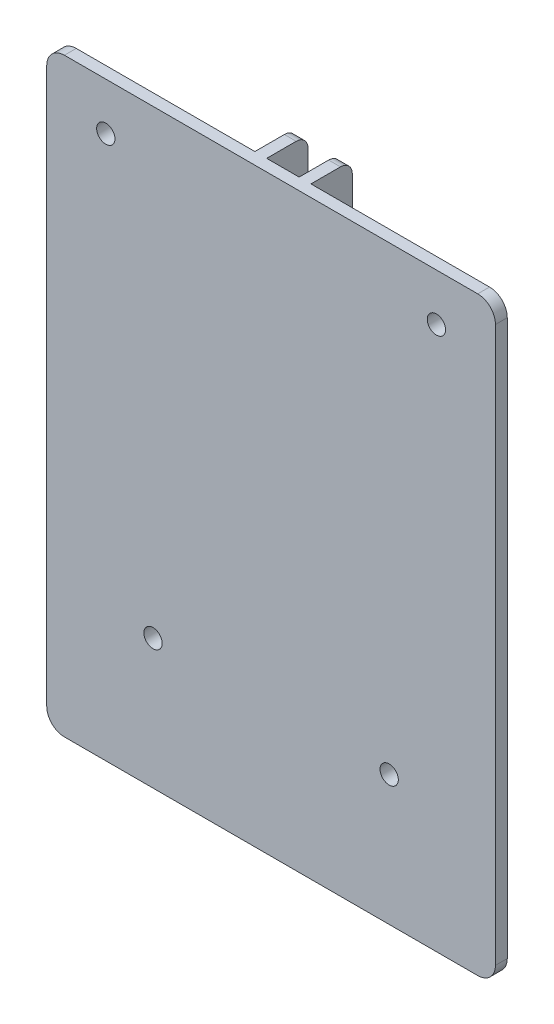
ISO-10303-21;
HEADER;
FILE_DESCRIPTION(('STEP AP214'),'2;1');
FILE_NAME('part.step','',(''),(''),'','','');
FILE_SCHEMA(('AUTOMOTIVE_DESIGN { 1 0 10303 214 1 1 1 1 }'));
ENDSEC;
DATA;
#1=APPLICATION_CONTEXT('core data for automotive mechanical design processes');
#2=APPLICATION_PROTOCOL_DEFINITION('international standard','automotive_design',2000,#1);
#3=PRODUCT_CONTEXT('',#1,'mechanical');
#4=PRODUCT('Part','Part','',(#3));
#5=PRODUCT_RELATED_PRODUCT_CATEGORY('part','',(#4));
#6=PRODUCT_DEFINITION_FORMATION('','',#4);
#7=PRODUCT_DEFINITION_CONTEXT('part definition',#1,'design');
#8=PRODUCT_DEFINITION('design','',#6,#7);
#9=PRODUCT_DEFINITION_SHAPE('','',#8);
#10=(LENGTH_UNIT() NAMED_UNIT(*) SI_UNIT(.MILLI.,.METRE.));
#11=(NAMED_UNIT(*) PLANE_ANGLE_UNIT() SI_UNIT($,.RADIAN.));
#12=(NAMED_UNIT(*) SI_UNIT($,.STERADIAN.) SOLID_ANGLE_UNIT());
#13=UNCERTAINTY_MEASURE_WITH_UNIT(LENGTH_MEASURE(1.E-05),#10,'distance_accuracy_value','');
#14=(GEOMETRIC_REPRESENTATION_CONTEXT(3) GLOBAL_UNCERTAINTY_ASSIGNED_CONTEXT((#13)) GLOBAL_UNIT_ASSIGNED_CONTEXT((#10,
#11,#12)) REPRESENTATION_CONTEXT('',''));
#15=CARTESIAN_POINT('',(0.,0.,0.));
#16=DIRECTION('',(0.,0.,1.));
#17=DIRECTION('',(1.,0.,0.));
#18=AXIS2_PLACEMENT_3D('',#15,#16,#17);
#19=CARTESIAN_POINT('',(0.,0.,9.));
#20=DIRECTION('',(1.,0.,0.));
#21=DIRECTION('',(0.,0.,-1.));
#22=AXIS2_PLACEMENT_3D('',#19,#20,#21);
#23=PLANE('',#22);
#24=DIRECTION('',(0.,1.,0.));
#25=VECTOR('',#24,1.);
#26=CARTESIAN_POINT('',(0.,100.,7.));
#27=LINE('',#26,#25);
#28=CARTESIAN_POINT('',(0.,3.,7.));
#29=VERTEX_POINT('',#28);
#30=CARTESIAN_POINT('',(0.,97.,7.));
#31=VERTEX_POINT('',#30);
#32=EDGE_CURVE('E202',#29,#31,#27,.T.);
#33=ORIENTED_EDGE('',*,*,#32,.F.);
#34=DIRECTION('',(0.,0.,-1.));
#35=VECTOR('',#34,1.);
#36=CARTESIAN_POINT('',(0.,3.,9.));
#37=LINE('',#36,#35);
#38=CARTESIAN_POINT('',(0.,3.,9.));
#39=VERTEX_POINT('',#38);
#40=EDGE_CURVE('E293',#29,#39,#37,.F.);
#41=ORIENTED_EDGE('',*,*,#40,.T.);
#42=DIRECTION('',(0.,-1.,0.));
#43=VECTOR('',#42,1.);
#44=CARTESIAN_POINT('',(0.,0.,9.));
#45=LINE('',#44,#43);
#46=CARTESIAN_POINT('',(0.,97.,9.));
#47=VERTEX_POINT('',#46);
#48=EDGE_CURVE('E211',#47,#39,#45,.T.);
#49=ORIENTED_EDGE('',*,*,#48,.F.);
#50=DIRECTION('',(0.,0.,-1.));
#51=VECTOR('',#50,1.);
#52=CARTESIAN_POINT('',(0.,97.,9.));
#53=LINE('',#52,#51);
#54=EDGE_CURVE('E290',#47,#31,#53,.T.);
#55=ORIENTED_EDGE('',*,*,#54,.T.);
#56=EDGE_LOOP('',(#33,#41,#49,#55));
#57=FACE_BOUND('',#56,.T.);
#58=ADVANCED_FACE('F32',(#57),#23,.F.);
#59=CARTESIAN_POINT('',(76.,0.,9.));
#60=DIRECTION('',(-1.,0.,0.));
#61=DIRECTION('',(0.,0.,1.));
#62=AXIS2_PLACEMENT_3D('',#59,#60,#61);
#63=PLANE('',#62);
#64=DIRECTION('',(0.,1.,0.));
#65=VECTOR('',#64,1.);
#66=CARTESIAN_POINT('',(76.,0.,9.));
#67=LINE('',#66,#65);
#68=CARTESIAN_POINT('',(76.,3.,9.));
#69=VERTEX_POINT('',#68);
#70=CARTESIAN_POINT('',(76.,97.,9.));
#71=VERTEX_POINT('',#70);
#72=EDGE_CURVE('E267',#69,#71,#67,.T.);
#73=ORIENTED_EDGE('',*,*,#72,.F.);
#74=DIRECTION('',(0.,0.,-1.));
#75=VECTOR('',#74,1.);
#76=CARTESIAN_POINT('',(76.,3.,9.));
#77=LINE('',#76,#75);
#78=CARTESIAN_POINT('',(76.,3.,7.));
#79=VERTEX_POINT('',#78);
#80=EDGE_CURVE('E305',#69,#79,#77,.T.);
#81=ORIENTED_EDGE('',*,*,#80,.T.);
#82=DIRECTION('',(0.,-1.,0.));
#83=VECTOR('',#82,1.);
#84=CARTESIAN_POINT('',(76.,100.,7.));
#85=LINE('',#84,#83);
#86=CARTESIAN_POINT('',(76.,97.,7.));
#87=VERTEX_POINT('',#86);
#88=EDGE_CURVE('E213',#87,#79,#85,.T.);
#89=ORIENTED_EDGE('',*,*,#88,.F.);
#90=DIRECTION('',(0.,0.,-1.));
#91=VECTOR('',#90,1.);
#92=CARTESIAN_POINT('',(76.,97.,9.));
#93=LINE('',#92,#91);
#94=EDGE_CURVE('E303',#87,#71,#93,.F.);
#95=ORIENTED_EDGE('',*,*,#94,.T.);
#96=EDGE_LOOP('',(#73,#81,#89,#95));
#97=FACE_BOUND('',#96,.T.);
#98=ADVANCED_FACE('F421',(#97),#63,.F.);
#99=CARTESIAN_POINT('',(0.,0.,0.));
#100=DIRECTION('',(0.,0.,-1.));
#101=DIRECTION('',(-1.,0.,0.));
#102=AXIS2_PLACEMENT_3D('',#99,#100,#101);
#103=PLANE('',#102);
#104=DIRECTION('',(0.,1.,0.));
#105=VECTOR('',#104,1.);
#106=CARTESIAN_POINT('',(35.25,100.,0.));
#107=LINE('',#106,#105);
#108=CARTESIAN_POINT('',(35.25,2.,0.));
#109=VERTEX_POINT('',#108);
#110=CARTESIAN_POINT('',(35.25,98.,0.));
#111=VERTEX_POINT('',#110);
#112=EDGE_CURVE('E247',#109,#111,#107,.T.);
#113=ORIENTED_EDGE('',*,*,#112,.F.);
#114=DIRECTION('',(1.,0.,0.));
#115=VECTOR('',#114,1.);
#116=CARTESIAN_POINT('',(33.25,2.,0.));
#117=LINE('',#116,#115);
#118=CARTESIAN_POINT('',(33.25,2.,0.));
#119=VERTEX_POINT('',#118);
#120=EDGE_CURVE('E328',#109,#119,#117,.F.);
#121=ORIENTED_EDGE('',*,*,#120,.T.);
#122=DIRECTION('',(0.,-1.,0.));
#123=VECTOR('',#122,1.);
#124=CARTESIAN_POINT('',(33.25,100.,0.));
#125=LINE('',#124,#123);
#126=CARTESIAN_POINT('',(33.25,98.,0.));
#127=VERTEX_POINT('',#126);
#128=EDGE_CURVE('E195',#127,#119,#125,.T.);
#129=ORIENTED_EDGE('',*,*,#128,.F.);
#130=DIRECTION('',(-1.,0.,0.));
#131=VECTOR('',#130,1.);
#132=CARTESIAN_POINT('',(35.25,98.,0.));
#133=LINE('',#132,#131);
#134=EDGE_CURVE('E326',#127,#111,#133,.F.);
#135=ORIENTED_EDGE('',*,*,#134,.T.);
#136=EDGE_LOOP('',(#113,#121,#129,#135));
#137=FACE_BOUND('',#136,.T.);
#138=ADVANCED_FACE('F427',(#137),#103,.T.);
#139=CARTESIAN_POINT('',(0.,0.,9.));
#140=DIRECTION('',(0.,1.,0.));
#141=DIRECTION('',(0.,0.,1.));
#142=AXIS2_PLACEMENT_3D('',#139,#140,#141);
#143=PLANE('',#142);
#144=DIRECTION('',(0.,0.,-1.));
#145=VECTOR('',#144,1.);
#146=CARTESIAN_POINT('',(33.25,0.,7.));
#147=LINE('',#146,#145);
#148=CARTESIAN_POINT('',(33.25,0.,7.));
#149=VERTEX_POINT('',#148);
#150=CARTESIAN_POINT('',(33.25,0.,2.));
#151=VERTEX_POINT('',#150);
#152=EDGE_CURVE('E174',#149,#151,#147,.T.);
#153=ORIENTED_EDGE('',*,*,#152,.T.);
#154=DIRECTION('',(1.,0.,0.));
#155=VECTOR('',#154,1.);
#156=CARTESIAN_POINT('',(35.25,0.,2.));
#157=LINE('',#156,#155);
#158=CARTESIAN_POINT('',(35.25,0.,2.));
#159=VERTEX_POINT('',#158);
#160=EDGE_CURVE('E320',#151,#159,#157,.T.);
#161=ORIENTED_EDGE('',*,*,#160,.T.);
#162=DIRECTION('',(0.,0.,-1.));
#163=VECTOR('',#162,1.);
#164=CARTESIAN_POINT('',(35.25,0.,7.));
#165=LINE('',#164,#163);
#166=CARTESIAN_POINT('',(35.25,0.,7.));
#167=VERTEX_POINT('',#166);
#168=EDGE_CURVE('E228',#167,#159,#165,.T.);
#169=ORIENTED_EDGE('',*,*,#168,.F.);
#170=DIRECTION('',(-1.,0.,0.));
#171=VECTOR('',#170,1.);
#172=CARTESIAN_POINT('',(35.25,0.,7.));
#173=LINE('',#172,#171);
#174=CARTESIAN_POINT('',(40.75,0.,7.));
#175=VERTEX_POINT('',#174);
#176=EDGE_CURVE('E243',#175,#167,#173,.T.);
#177=ORIENTED_EDGE('',*,*,#176,.F.);
#178=DIRECTION('',(0.,0.,-1.));
#179=VECTOR('',#178,1.);
#180=CARTESIAN_POINT('',(40.75,0.,7.));
#181=LINE('',#180,#179);
#182=CARTESIAN_POINT('',(40.75,0.,2.));
#183=VERTEX_POINT('',#182);
#184=EDGE_CURVE('E254',#175,#183,#181,.T.);
#185=ORIENTED_EDGE('',*,*,#184,.T.);
#186=DIRECTION('',(1.,0.,0.));
#187=VECTOR('',#186,1.);
#188=CARTESIAN_POINT('',(42.75,0.,2.));
#189=LINE('',#188,#187);
#190=CARTESIAN_POINT('',(42.75,0.,2.));
#191=VERTEX_POINT('',#190);
#192=EDGE_CURVE('E317',#183,#191,#189,.T.);
#193=ORIENTED_EDGE('',*,*,#192,.T.);
#194=DIRECTION('',(0.,0.,-1.));
#195=VECTOR('',#194,1.);
#196=CARTESIAN_POINT('',(42.75,0.,7.));
#197=LINE('',#196,#195);
#198=CARTESIAN_POINT('',(42.75,0.,7.));
#199=VERTEX_POINT('',#198);
#200=EDGE_CURVE('E225',#199,#191,#197,.T.);
#201=ORIENTED_EDGE('',*,*,#200,.F.);
#202=DIRECTION('',(-1.,0.,0.));
#203=VECTOR('',#202,1.);
#204=CARTESIAN_POINT('',(76.,0.,7.));
#205=LINE('',#204,#203);
#206=CARTESIAN_POINT('',(73.,0.,7.));
#207=VERTEX_POINT('',#206);
#208=EDGE_CURVE('E216',#207,#199,#205,.T.);
#209=ORIENTED_EDGE('',*,*,#208,.F.);
#210=DIRECTION('',(0.,0.,-1.));
#211=VECTOR('',#210,1.);
#212=CARTESIAN_POINT('',(73.,0.,9.));
#213=LINE('',#212,#211);
#214=CARTESIAN_POINT('',(73.,0.,9.));
#215=VERTEX_POINT('',#214);
#216=EDGE_CURVE('E273',#207,#215,#213,.F.);
#217=ORIENTED_EDGE('',*,*,#216,.T.);
#218=DIRECTION('',(1.,0.,0.));
#219=VECTOR('',#218,1.);
#220=CARTESIAN_POINT('',(0.,0.,9.));
#221=LINE('',#220,#219);
#222=CARTESIAN_POINT('',(3.,0.,9.));
#223=VERTEX_POINT('',#222);
#224=EDGE_CURVE('E264',#223,#215,#221,.T.);
#225=ORIENTED_EDGE('',*,*,#224,.F.);
#226=DIRECTION('',(0.,0.,-1.));
#227=VECTOR('',#226,1.);
#228=CARTESIAN_POINT('',(3.,0.,9.));
#229=LINE('',#228,#227);
#230=CARTESIAN_POINT('',(3.,0.,7.));
#231=VERTEX_POINT('',#230);
#232=EDGE_CURVE('E201',#223,#231,#229,.T.);
#233=ORIENTED_EDGE('',*,*,#232,.T.);
#234=DIRECTION('',(-1.,0.,0.));
#235=VECTOR('',#234,1.);
#236=CARTESIAN_POINT('',(33.25,0.,7.));
#237=LINE('',#236,#235);
#238=EDGE_CURVE('E193',#149,#231,#237,.T.);
#239=ORIENTED_EDGE('',*,*,#238,.F.);
#240=EDGE_LOOP('',(#153,#161,#169,#177,#185,#193,#201,#209,#217,#225,#233,#239));
#241=FACE_BOUND('',#240,.T.);
#242=ADVANCED_FACE('F198',(#241),#143,.F.);
#243=CARTESIAN_POINT('',(0.,100.,9.));
#244=DIRECTION('',(0.,-1.,0.));
#245=DIRECTION('',(0.,0.,-1.));
#246=AXIS2_PLACEMENT_3D('',#243,#244,#245);
#247=PLANE('',#246);
#248=DIRECTION('',(0.,0.,-1.));
#249=VECTOR('',#248,1.);
#250=CARTESIAN_POINT('',(35.25,100.,7.));
#251=LINE('',#250,#249);
#252=CARTESIAN_POINT('',(35.25,100.,7.));
#253=VERTEX_POINT('',#252);
#254=CARTESIAN_POINT('',(35.25,100.,2.));
#255=VERTEX_POINT('',#254);
#256=EDGE_CURVE('E246',#253,#255,#251,.T.);
#257=ORIENTED_EDGE('',*,*,#256,.T.);
#258=DIRECTION('',(-1.,0.,0.));
#259=VECTOR('',#258,1.);
#260=CARTESIAN_POINT('',(33.25,100.,2.));
#261=LINE('',#260,#259);
#262=CARTESIAN_POINT('',(33.25,100.,2.));
#263=VERTEX_POINT('',#262);
#264=EDGE_CURVE('E11',#255,#263,#261,.T.);
#265=ORIENTED_EDGE('',*,*,#264,.T.);
#266=DIRECTION('',(0.,0.,-1.));
#267=VECTOR('',#266,1.);
#268=CARTESIAN_POINT('',(33.25,100.,7.));
#269=LINE('',#268,#267);
#270=CARTESIAN_POINT('',(33.25,100.,7.));
#271=VERTEX_POINT('',#270);
#272=EDGE_CURVE('E187',#271,#263,#269,.T.);
#273=ORIENTED_EDGE('',*,*,#272,.F.);
#274=DIRECTION('',(1.,0.,0.));
#275=VECTOR('',#274,1.);
#276=CARTESIAN_POINT('',(33.25,100.,7.));
#277=LINE('',#276,#275);
#278=CARTESIAN_POINT('',(3.,100.,7.));
#279=VERTEX_POINT('',#278);
#280=EDGE_CURVE('E188',#279,#271,#277,.T.);
#281=ORIENTED_EDGE('',*,*,#280,.F.);
#282=DIRECTION('',(0.,0.,-1.));
#283=VECTOR('',#282,1.);
#284=CARTESIAN_POINT('',(3.,100.,9.));
#285=LINE('',#284,#283);
#286=CARTESIAN_POINT('',(3.,100.,9.));
#287=VERTEX_POINT('',#286);
#288=EDGE_CURVE('E315',#279,#287,#285,.F.);
#289=ORIENTED_EDGE('',*,*,#288,.T.);
#290=DIRECTION('',(-1.,0.,0.));
#291=VECTOR('',#290,1.);
#292=CARTESIAN_POINT('',(0.,100.,9.));
#293=LINE('',#292,#291);
#294=CARTESIAN_POINT('',(73.,100.,9.));
#295=VERTEX_POINT('',#294);
#296=EDGE_CURVE('E270',#295,#287,#293,.T.);
#297=ORIENTED_EDGE('',*,*,#296,.F.);
#298=DIRECTION('',(0.,0.,-1.));
#299=VECTOR('',#298,1.);
#300=CARTESIAN_POINT('',(73.,100.,9.));
#301=LINE('',#300,#299);
#302=CARTESIAN_POINT('',(73.,100.,7.));
#303=VERTEX_POINT('',#302);
#304=EDGE_CURVE('E312',#295,#303,#301,.T.);
#305=ORIENTED_EDGE('',*,*,#304,.T.);
#306=DIRECTION('',(1.,0.,0.));
#307=VECTOR('',#306,1.);
#308=CARTESIAN_POINT('',(76.,100.,7.));
#309=LINE('',#308,#307);
#310=CARTESIAN_POINT('',(42.75,100.,7.));
#311=VERTEX_POINT('',#310);
#312=EDGE_CURVE('E222',#311,#303,#309,.T.);
#313=ORIENTED_EDGE('',*,*,#312,.F.);
#314=DIRECTION('',(0.,0.,-1.));
#315=VECTOR('',#314,1.);
#316=CARTESIAN_POINT('',(42.75,100.,7.));
#317=LINE('',#316,#315);
#318=CARTESIAN_POINT('',(42.75,100.,2.));
#319=VERTEX_POINT('',#318);
#320=EDGE_CURVE('E210',#311,#319,#317,.T.);
#321=ORIENTED_EDGE('',*,*,#320,.T.);
#322=DIRECTION('',(-1.,0.,0.));
#323=VECTOR('',#322,1.);
#324=CARTESIAN_POINT('',(40.75,100.,2.));
#325=LINE('',#324,#323);
#326=CARTESIAN_POINT('',(40.75,100.,2.));
#327=VERTEX_POINT('',#326);
#328=EDGE_CURVE('E41',#319,#327,#325,.T.);
#329=ORIENTED_EDGE('',*,*,#328,.T.);
#330=DIRECTION('',(0.,0.,-1.));
#331=VECTOR('',#330,1.);
#332=CARTESIAN_POINT('',(40.75,100.,7.));
#333=LINE('',#332,#331);
#334=CARTESIAN_POINT('',(40.75,100.,7.));
#335=VERTEX_POINT('',#334);
#336=EDGE_CURVE('E257',#335,#327,#333,.T.);
#337=ORIENTED_EDGE('',*,*,#336,.F.);
#338=DIRECTION('',(1.,0.,0.));
#339=VECTOR('',#338,1.);
#340=CARTESIAN_POINT('',(35.25,100.,7.));
#341=LINE('',#340,#339);
#342=EDGE_CURVE('E236',#253,#335,#341,.T.);
#343=ORIENTED_EDGE('',*,*,#342,.F.);
#344=EDGE_LOOP('',(#257,#265,#273,#281,#289,#297,#305,#313,#321,#329,#337,#343));
#345=FACE_BOUND('',#344,.T.);
#346=ADVANCED_FACE('F469',(#345),#247,.F.);
#347=CARTESIAN_POINT('',(0.,0.,9.));
#348=DIRECTION('',(0.,0.,-1.));
#349=DIRECTION('',(-1.,0.,0.));
#350=AXIS2_PLACEMENT_3D('',#347,#348,#349);
#351=PLANE('',#350);
#352=CARTESIAN_POINT('',(66.,92.,9.));
#353=DIRECTION('',(0.,0.,-1.));
#354=DIRECTION('',(-1.,0.,0.));
#355=AXIS2_PLACEMENT_3D('',#352,#353,#354);
#356=CIRCLE('',#355,1.54999999999999);
#357=CARTESIAN_POINT('',(64.45,92.,9.));
#358=VERTEX_POINT('',#357);
#359=EDGE_CURVE('E348',#358,#358,#356,.T.);
#360=ORIENTED_EDGE('',*,*,#359,.T.);
#361=EDGE_LOOP('',(#360));
#362=FACE_BOUND('',#361,.T.);
#363=CARTESIAN_POINT('',(58.,22.,9.));
#364=DIRECTION('',(0.,0.,-1.));
#365=DIRECTION('',(-1.,0.,0.));
#366=AXIS2_PLACEMENT_3D('',#363,#364,#365);
#367=CIRCLE('',#366,1.55);
#368=CARTESIAN_POINT('',(56.45,22.,9.));
#369=VERTEX_POINT('',#368);
#370=EDGE_CURVE('E742',#369,#369,#367,.T.);
#371=ORIENTED_EDGE('',*,*,#370,.T.);
#372=EDGE_LOOP('',(#371));
#373=FACE_BOUND('',#372,.T.);
#374=CARTESIAN_POINT('',(18.,22.,9.));
#375=DIRECTION('',(0.,0.,-1.));
#376=DIRECTION('',(-1.,0.,0.));
#377=AXIS2_PLACEMENT_3D('',#374,#375,#376);
#378=CIRCLE('',#377,1.55);
#379=CARTESIAN_POINT('',(16.45,22.,9.));
#380=VERTEX_POINT('',#379);
#381=EDGE_CURVE('E745',#380,#380,#378,.T.);
#382=ORIENTED_EDGE('',*,*,#381,.T.);
#383=EDGE_LOOP('',(#382));
#384=FACE_BOUND('',#383,.T.);
#385=CARTESIAN_POINT('',(10.,92.,9.));
#386=DIRECTION('',(0.,0.,-1.));
#387=DIRECTION('',(-1.,0.,0.));
#388=AXIS2_PLACEMENT_3D('',#385,#386,#387);
#389=CIRCLE('',#388,1.54999999999999);
#390=CARTESIAN_POINT('',(8.45000000000001,92.,9.));
#391=VERTEX_POINT('',#390);
#392=EDGE_CURVE('E749',#391,#391,#389,.T.);
#393=ORIENTED_EDGE('',*,*,#392,.T.);
#394=EDGE_LOOP('',(#393));
#395=FACE_BOUND('',#394,.T.);
#396=ORIENTED_EDGE('',*,*,#48,.T.);
#397=CARTESIAN_POINT('',(3.,3.,9.));
#398=DIRECTION('',(0.,0.,-1.));
#399=DIRECTION('',(-1.,0.,0.));
#400=AXIS2_PLACEMENT_3D('',#397,#398,#399);
#401=CIRCLE('',#400,3.);
#402=EDGE_CURVE('E301',#39,#223,#401,.F.);
#403=ORIENTED_EDGE('',*,*,#402,.T.);
#404=ORIENTED_EDGE('',*,*,#224,.T.);
#405=CARTESIAN_POINT('',(73.,3.,9.));
#406=DIRECTION('',(0.,0.,-1.));
#407=DIRECTION('',(-1.,0.,0.));
#408=AXIS2_PLACEMENT_3D('',#405,#406,#407);
#409=CIRCLE('',#408,3.);
#410=EDGE_CURVE('E299',#215,#69,#409,.F.);
#411=ORIENTED_EDGE('',*,*,#410,.T.);
#412=ORIENTED_EDGE('',*,*,#72,.T.);
#413=CARTESIAN_POINT('',(73.,97.,9.));
#414=DIRECTION('',(0.,0.,-1.));
#415=DIRECTION('',(-1.,0.,0.));
#416=AXIS2_PLACEMENT_3D('',#413,#414,#415);
#417=CIRCLE('',#416,3.);
#418=EDGE_CURVE('E295',#71,#295,#417,.F.);
#419=ORIENTED_EDGE('',*,*,#418,.T.);
#420=ORIENTED_EDGE('',*,*,#296,.T.);
#421=CARTESIAN_POINT('',(3.,97.,9.));
#422=DIRECTION('',(0.,0.,-1.));
#423=DIRECTION('',(-1.,0.,0.));
#424=AXIS2_PLACEMENT_3D('',#421,#422,#423);
#425=CIRCLE('',#424,3.);
#426=EDGE_CURVE('E297',#287,#47,#425,.F.);
#427=ORIENTED_EDGE('',*,*,#426,.T.);
#428=EDGE_LOOP('',(#396,#403,#404,#411,#412,#419,#420,#427));
#429=FACE_BOUND('',#428,.T.);
#430=ADVANCED_FACE('F484',(#362,#373,#384,#395,#429),#351,.F.);
#431=DIRECTION('',(0.,1.,0.));
#432=VECTOR('',#431,1.);
#433=CARTESIAN_POINT('',(42.75,100.,0.));
#434=LINE('',#433,#432);
#435=CARTESIAN_POINT('',(42.75,2.,0.));
#436=VERTEX_POINT('',#435);
#437=CARTESIAN_POINT('',(42.75,98.,0.));
#438=VERTEX_POINT('',#437);
#439=EDGE_CURVE('E217',#436,#438,#434,.T.);
#440=ORIENTED_EDGE('',*,*,#439,.F.);
#441=DIRECTION('',(1.,0.,0.));
#442=VECTOR('',#441,1.);
#443=CARTESIAN_POINT('',(40.75,2.,0.));
#444=LINE('',#443,#442);
#445=CARTESIAN_POINT('',(40.75,2.,0.));
#446=VERTEX_POINT('',#445);
#447=EDGE_CURVE('E57',#436,#446,#444,.F.);
#448=ORIENTED_EDGE('',*,*,#447,.T.);
#449=DIRECTION('',(0.,-1.,0.));
#450=VECTOR('',#449,1.);
#451=CARTESIAN_POINT('',(40.75,100.,0.));
#452=LINE('',#451,#450);
#453=CARTESIAN_POINT('',(40.75,98.,0.));
#454=VERTEX_POINT('',#453);
#455=EDGE_CURVE('E237',#454,#446,#452,.T.);
#456=ORIENTED_EDGE('',*,*,#455,.F.);
#457=DIRECTION('',(-1.,0.,0.));
#458=VECTOR('',#457,1.);
#459=CARTESIAN_POINT('',(42.75,98.,0.));
#460=LINE('',#459,#458);
#461=EDGE_CURVE('E337',#454,#438,#460,.F.);
#462=ORIENTED_EDGE('',*,*,#461,.T.);
#463=EDGE_LOOP('',(#440,#448,#456,#462));
#464=FACE_BOUND('',#463,.T.);
#465=ADVANCED_FACE('F506',(#464),#103,.T.);
#466=CARTESIAN_POINT('',(35.25,100.,7.));
#467=DIRECTION('',(-1.,0.,0.));
#468=DIRECTION('',(0.,-1.,0.));
#469=AXIS2_PLACEMENT_3D('',#466,#467,#468);
#470=PLANE('',#469);
#471=CARTESIAN_POINT('',(35.25,15.,3.5));
#472=DIRECTION('',(-1.,0.,0.));
#473=DIRECTION('',(0.,-1.,0.));
#474=AXIS2_PLACEMENT_3D('',#471,#472,#473);
#475=CIRCLE('',#474,1.55);
#476=CARTESIAN_POINT('',(35.25,13.45,3.5));
#477=VERTEX_POINT('',#476);
#478=EDGE_CURVE('E250',#477,#477,#475,.T.);
#479=ORIENTED_EDGE('',*,*,#478,.T.);
#480=EDGE_LOOP('',(#479));
#481=FACE_BOUND('',#480,.T.);
#482=CARTESIAN_POINT('',(35.25,85.,3.5));
#483=DIRECTION('',(-1.,0.,0.));
#484=DIRECTION('',(0.,-1.,0.));
#485=AXIS2_PLACEMENT_3D('',#482,#483,#484);
#486=CIRCLE('',#485,1.54999999999999);
#487=CARTESIAN_POINT('',(35.25,83.45,3.5));
#488=VERTEX_POINT('',#487);
#489=EDGE_CURVE('E283',#488,#488,#486,.T.);
#490=ORIENTED_EDGE('',*,*,#489,.T.);
#491=EDGE_LOOP('',(#490));
#492=FACE_BOUND('',#491,.T.);
#493=ORIENTED_EDGE('',*,*,#168,.T.);
#494=CARTESIAN_POINT('',(35.25,2.,2.));
#495=DIRECTION('',(-1.,0.,0.));
#496=DIRECTION('',(0.,-1.,0.));
#497=AXIS2_PLACEMENT_3D('',#494,#495,#496);
#498=CIRCLE('',#497,2.);
#499=EDGE_CURVE('E324',#159,#109,#498,.F.);
#500=ORIENTED_EDGE('',*,*,#499,.T.);
#501=ORIENTED_EDGE('',*,*,#112,.T.);
#502=CARTESIAN_POINT('',(35.25,98.,2.));
#503=DIRECTION('',(-1.,0.,0.));
#504=DIRECTION('',(0.,-1.,0.));
#505=AXIS2_PLACEMENT_3D('',#502,#503,#504);
#506=CIRCLE('',#505,2.);
#507=EDGE_CURVE('E322',#111,#255,#506,.F.);
#508=ORIENTED_EDGE('',*,*,#507,.T.);
#509=ORIENTED_EDGE('',*,*,#256,.F.);
#510=DIRECTION('',(0.,1.,0.));
#511=VECTOR('',#510,1.);
#512=CARTESIAN_POINT('',(35.25,100.,7.));
#513=LINE('',#512,#511);
#514=EDGE_CURVE('E233',#167,#253,#513,.T.);
#515=ORIENTED_EDGE('',*,*,#514,.F.);
#516=EDGE_LOOP('',(#493,#500,#501,#508,#509,#515));
#517=FACE_BOUND('',#516,.T.);
#518=ADVANCED_FACE('F398',(#481,#492,#517),#470,.F.);
#519=CARTESIAN_POINT('',(40.75,100.,7.));
#520=DIRECTION('',(1.,0.,0.));
#521=DIRECTION('',(0.,1.,0.));
#522=AXIS2_PLACEMENT_3D('',#519,#520,#521);
#523=PLANE('',#522);
#524=CARTESIAN_POINT('',(40.75,15.,3.5));
#525=DIRECTION('',(1.,0.,0.));
#526=DIRECTION('',(0.,1.,0.));
#527=AXIS2_PLACEMENT_3D('',#524,#525,#526);
#528=CIRCLE('',#527,1.55);
#529=CARTESIAN_POINT('',(40.75,16.55,3.5));
#530=VERTEX_POINT('',#529);
#531=EDGE_CURVE('E282',#530,#530,#528,.T.);
#532=ORIENTED_EDGE('',*,*,#531,.T.);
#533=EDGE_LOOP('',(#532));
#534=FACE_BOUND('',#533,.T.);
#535=CARTESIAN_POINT('',(40.75,85.,3.5));
#536=DIRECTION('',(1.,0.,0.));
#537=DIRECTION('',(0.,1.,0.));
#538=AXIS2_PLACEMENT_3D('',#535,#536,#537);
#539=CIRCLE('',#538,1.54999999999999);
#540=CARTESIAN_POINT('',(40.75,86.55,3.5));
#541=VERTEX_POINT('',#540);
#542=EDGE_CURVE('E277',#541,#541,#539,.T.);
#543=ORIENTED_EDGE('',*,*,#542,.T.);
#544=EDGE_LOOP('',(#543));
#545=FACE_BOUND('',#544,.T.);
#546=ORIENTED_EDGE('',*,*,#455,.T.);
#547=CARTESIAN_POINT('',(40.75,2.,2.));
#548=DIRECTION('',(1.,0.,0.));
#549=DIRECTION('',(0.,1.,0.));
#550=AXIS2_PLACEMENT_3D('',#547,#548,#549);
#551=CIRCLE('',#550,2.);
#552=EDGE_CURVE('E341',#446,#183,#551,.F.);
#553=ORIENTED_EDGE('',*,*,#552,.T.);
#554=ORIENTED_EDGE('',*,*,#184,.F.);
#555=DIRECTION('',(0.,-1.,0.));
#556=VECTOR('',#555,1.);
#557=CARTESIAN_POINT('',(40.75,100.,7.));
#558=LINE('',#557,#556);
#559=EDGE_CURVE('E240',#335,#175,#558,.T.);
#560=ORIENTED_EDGE('',*,*,#559,.F.);
#561=ORIENTED_EDGE('',*,*,#336,.T.);
#562=CARTESIAN_POINT('',(40.75,98.,2.));
#563=DIRECTION('',(1.,0.,0.));
#564=DIRECTION('',(0.,1.,0.));
#565=AXIS2_PLACEMENT_3D('',#562,#563,#564);
#566=CIRCLE('',#565,2.);
#567=EDGE_CURVE('E49',#327,#454,#566,.F.);
#568=ORIENTED_EDGE('',*,*,#567,.T.);
#569=EDGE_LOOP('',(#546,#553,#554,#560,#561,#568));
#570=FACE_BOUND('',#569,.T.);
#571=ADVANCED_FACE('F508',(#534,#545,#570),#523,.F.);
#572=CARTESIAN_POINT('',(0.,0.,7.));
#573=DIRECTION('',(0.,0.,1.));
#574=DIRECTION('',(1.,0.,0.));
#575=AXIS2_PLACEMENT_3D('',#572,#573,#574);
#576=PLANE('',#575);
#577=ORIENTED_EDGE('',*,*,#514,.T.);
#578=ORIENTED_EDGE('',*,*,#342,.T.);
#579=ORIENTED_EDGE('',*,*,#559,.T.);
#580=ORIENTED_EDGE('',*,*,#176,.T.);
#581=EDGE_LOOP('',(#577,#578,#579,#580));
#582=FACE_BOUND('',#581,.T.);
#583=ADVANCED_FACE('F472',(#582),#576,.F.);
#584=CARTESIAN_POINT('',(42.75,100.,7.));
#585=DIRECTION('',(-1.,0.,0.));
#586=DIRECTION('',(0.,-1.,0.));
#587=AXIS2_PLACEMENT_3D('',#584,#585,#586);
#588=PLANE('',#587);
#589=CARTESIAN_POINT('',(42.75,15.,3.5));
#590=DIRECTION('',(1.,0.,0.));
#591=DIRECTION('',(0.,1.,0.));
#592=AXIS2_PLACEMENT_3D('',#589,#590,#591);
#593=CIRCLE('',#592,1.55);
#594=CARTESIAN_POINT('',(42.75,16.55,3.5));
#595=VERTEX_POINT('',#594);
#596=EDGE_CURVE('E278',#595,#595,#593,.T.);
#597=ORIENTED_EDGE('',*,*,#596,.F.);
#598=EDGE_LOOP('',(#597));
#599=FACE_BOUND('',#598,.T.);
#600=CARTESIAN_POINT('',(42.75,85.,3.5));
#601=DIRECTION('',(1.,0.,0.));
#602=DIRECTION('',(0.,1.,0.));
#603=AXIS2_PLACEMENT_3D('',#600,#601,#602);
#604=CIRCLE('',#603,1.54999999999999);
#605=CARTESIAN_POINT('',(42.75,86.55,3.5));
#606=VERTEX_POINT('',#605);
#607=EDGE_CURVE('E383',#606,#606,#604,.T.);
#608=ORIENTED_EDGE('',*,*,#607,.F.);
#609=EDGE_LOOP('',(#608));
#610=FACE_BOUND('',#609,.T.);
#611=ORIENTED_EDGE('',*,*,#200,.T.);
#612=CARTESIAN_POINT('',(42.75,2.,2.));
#613=DIRECTION('',(-1.,0.,0.));
#614=DIRECTION('',(0.,-1.,0.));
#615=AXIS2_PLACEMENT_3D('',#612,#613,#614);
#616=CIRCLE('',#615,2.);
#617=EDGE_CURVE('E335',#191,#436,#616,.F.);
#618=ORIENTED_EDGE('',*,*,#617,.T.);
#619=ORIENTED_EDGE('',*,*,#439,.T.);
#620=CARTESIAN_POINT('',(42.75,98.,2.));
#621=DIRECTION('',(-1.,0.,0.));
#622=DIRECTION('',(0.,-1.,0.));
#623=AXIS2_PLACEMENT_3D('',#620,#621,#622);
#624=CIRCLE('',#623,2.);
#625=EDGE_CURVE('E333',#438,#319,#624,.F.);
#626=ORIENTED_EDGE('',*,*,#625,.T.);
#627=ORIENTED_EDGE('',*,*,#320,.F.);
#628=DIRECTION('',(0.,1.,0.));
#629=VECTOR('',#628,1.);
#630=CARTESIAN_POINT('',(42.75,100.,7.));
#631=LINE('',#630,#629);
#632=EDGE_CURVE('E219',#199,#311,#631,.T.);
#633=ORIENTED_EDGE('',*,*,#632,.F.);
#634=EDGE_LOOP('',(#611,#618,#619,#626,#627,#633));
#635=FACE_BOUND('',#634,.T.);
#636=ADVANCED_FACE('F502',(#599,#610,#635),#588,.F.);
#637=CARTESIAN_POINT('',(0.,0.,7.));
#638=DIRECTION('',(0.,0.,-1.));
#639=DIRECTION('',(-1.,0.,0.));
#640=AXIS2_PLACEMENT_3D('',#637,#638,#639);
#641=PLANE('',#640);
#642=CARTESIAN_POINT('',(58.,22.,7.));
#643=DIRECTION('',(0.,0.,-1.));
#644=DIRECTION('',(-1.,0.,0.));
#645=AXIS2_PLACEMENT_3D('',#642,#643,#644);
#646=CIRCLE('',#645,3.);
#647=CARTESIAN_POINT('',(55.,22.,7.));
#648=VERTEX_POINT('',#647);
#649=EDGE_CURVE('E355',#648,#648,#646,.T.);
#650=ORIENTED_EDGE('',*,*,#649,.F.);
#651=EDGE_LOOP('',(#650));
#652=FACE_BOUND('',#651,.T.);
#653=CARTESIAN_POINT('',(66.,92.,7.));
#654=DIRECTION('',(0.,0.,-1.));
#655=DIRECTION('',(-1.,0.,0.));
#656=AXIS2_PLACEMENT_3D('',#653,#654,#655);
#657=CIRCLE('',#656,3.00000000000001);
#658=CARTESIAN_POINT('',(63.,92.,7.));
#659=VERTEX_POINT('',#658);
#660=EDGE_CURVE('E377',#659,#659,#657,.T.);
#661=ORIENTED_EDGE('',*,*,#660,.F.);
#662=EDGE_LOOP('',(#661));
#663=FACE_BOUND('',#662,.T.);
#664=ORIENTED_EDGE('',*,*,#88,.T.);
#665=CARTESIAN_POINT('',(73.,3.,7.));
#666=DIRECTION('',(0.,0.,-1.));
#667=DIRECTION('',(-1.,0.,0.));
#668=AXIS2_PLACEMENT_3D('',#665,#666,#667);
#669=CIRCLE('',#668,3.);
#670=EDGE_CURVE('E310',#79,#207,#669,.T.);
#671=ORIENTED_EDGE('',*,*,#670,.T.);
#672=ORIENTED_EDGE('',*,*,#208,.T.);
#673=ORIENTED_EDGE('',*,*,#632,.T.);
#674=ORIENTED_EDGE('',*,*,#312,.T.);
#675=CARTESIAN_POINT('',(73.,97.,7.));
#676=DIRECTION('',(0.,0.,-1.));
#677=DIRECTION('',(-1.,0.,0.));
#678=AXIS2_PLACEMENT_3D('',#675,#676,#677);
#679=CIRCLE('',#678,3.);
#680=EDGE_CURVE('E308',#303,#87,#679,.T.);
#681=ORIENTED_EDGE('',*,*,#680,.T.);
#682=EDGE_LOOP('',(#664,#671,#672,#673,#674,#681));
#683=FACE_BOUND('',#682,.T.);
#684=ADVANCED_FACE('F499',(#652,#663,#683),#641,.T.);
#685=CARTESIAN_POINT('',(33.25,100.,7.));
#686=DIRECTION('',(1.,0.,0.));
#687=DIRECTION('',(0.,1.,0.));
#688=AXIS2_PLACEMENT_3D('',#685,#686,#687);
#689=PLANE('',#688);
#690=CARTESIAN_POINT('',(33.25,15.,3.5));
#691=DIRECTION('',(1.,0.,0.));
#692=DIRECTION('',(0.,1.,0.));
#693=AXIS2_PLACEMENT_3D('',#690,#691,#692);
#694=CIRCLE('',#693,1.55);
#695=CARTESIAN_POINT('',(33.25,16.55,3.5));
#696=VERTEX_POINT('',#695);
#697=EDGE_CURVE('E279',#696,#696,#694,.T.);
#698=ORIENTED_EDGE('',*,*,#697,.T.);
#699=EDGE_LOOP('',(#698));
#700=FACE_BOUND('',#699,.T.);
#701=CARTESIAN_POINT('',(33.25,85.,3.5));
#702=DIRECTION('',(1.,0.,0.));
#703=DIRECTION('',(0.,1.,0.));
#704=AXIS2_PLACEMENT_3D('',#701,#702,#703);
#705=CIRCLE('',#704,1.54999999999999);
#706=CARTESIAN_POINT('',(33.25,86.55,3.5));
#707=VERTEX_POINT('',#706);
#708=EDGE_CURVE('E274',#707,#707,#705,.T.);
#709=ORIENTED_EDGE('',*,*,#708,.T.);
#710=EDGE_LOOP('',(#709));
#711=FACE_BOUND('',#710,.T.);
#712=ORIENTED_EDGE('',*,*,#128,.T.);
#713=CARTESIAN_POINT('',(33.25,2.,2.));
#714=DIRECTION('',(1.,0.,0.));
#715=DIRECTION('',(0.,1.,0.));
#716=AXIS2_PLACEMENT_3D('',#713,#714,#715);
#717=CIRCLE('',#716,2.);
#718=EDGE_CURVE('E182',#119,#151,#717,.F.);
#719=ORIENTED_EDGE('',*,*,#718,.T.);
#720=ORIENTED_EDGE('',*,*,#152,.F.);
#721=DIRECTION('',(0.,-1.,0.));
#722=VECTOR('',#721,1.);
#723=CARTESIAN_POINT('',(33.25,100.,7.));
#724=LINE('',#723,#722);
#725=EDGE_CURVE('E179',#271,#149,#724,.T.);
#726=ORIENTED_EDGE('',*,*,#725,.F.);
#727=ORIENTED_EDGE('',*,*,#272,.T.);
#728=CARTESIAN_POINT('',(33.25,98.,2.));
#729=DIRECTION('',(1.,0.,0.));
#730=DIRECTION('',(0.,1.,0.));
#731=AXIS2_PLACEMENT_3D('',#728,#729,#730);
#732=CIRCLE('',#731,2.);
#733=EDGE_CURVE('E330',#263,#127,#732,.F.);
#734=ORIENTED_EDGE('',*,*,#733,.T.);
#735=EDGE_LOOP('',(#712,#719,#720,#726,#727,#734));
#736=FACE_BOUND('',#735,.T.);
#737=ADVANCED_FACE('F177',(#700,#711,#736),#689,.F.);
#738=CARTESIAN_POINT('',(0.,0.,7.));
#739=DIRECTION('',(0.,0.,-1.));
#740=DIRECTION('',(-1.,0.,0.));
#741=AXIS2_PLACEMENT_3D('',#738,#739,#740);
#742=PLANE('',#741);
#743=CARTESIAN_POINT('',(18.,22.,7.));
#744=DIRECTION('',(0.,0.,-1.));
#745=DIRECTION('',(-1.,0.,0.));
#746=AXIS2_PLACEMENT_3D('',#743,#744,#745);
#747=CIRCLE('',#746,3.);
#748=CARTESIAN_POINT('',(15.,22.,7.));
#749=VERTEX_POINT('',#748);
#750=EDGE_CURVE('E364',#749,#749,#747,.T.);
#751=ORIENTED_EDGE('',*,*,#750,.F.);
#752=EDGE_LOOP('',(#751));
#753=FACE_BOUND('',#752,.T.);
#754=CARTESIAN_POINT('',(10.,92.,7.));
#755=DIRECTION('',(0.,0.,-1.));
#756=DIRECTION('',(-1.,0.,0.));
#757=AXIS2_PLACEMENT_3D('',#754,#755,#756);
#758=CIRCLE('',#757,3.);
#759=CARTESIAN_POINT('',(7.,92.,7.));
#760=VERTEX_POINT('',#759);
#761=EDGE_CURVE('E371',#760,#760,#758,.T.);
#762=ORIENTED_EDGE('',*,*,#761,.F.);
#763=EDGE_LOOP('',(#762));
#764=FACE_BOUND('',#763,.T.);
#765=ORIENTED_EDGE('',*,*,#238,.T.);
#766=CARTESIAN_POINT('',(3.,3.,7.));
#767=DIRECTION('',(0.,0.,-1.));
#768=DIRECTION('',(-1.,0.,0.));
#769=AXIS2_PLACEMENT_3D('',#766,#767,#768);
#770=CIRCLE('',#769,3.);
#771=EDGE_CURVE('E288',#231,#29,#770,.T.);
#772=ORIENTED_EDGE('',*,*,#771,.T.);
#773=ORIENTED_EDGE('',*,*,#32,.T.);
#774=CARTESIAN_POINT('',(3.,97.,7.));
#775=DIRECTION('',(0.,0.,-1.));
#776=DIRECTION('',(-1.,0.,0.));
#777=AXIS2_PLACEMENT_3D('',#774,#775,#776);
#778=CIRCLE('',#777,3.);
#779=EDGE_CURVE('E286',#31,#279,#778,.T.);
#780=ORIENTED_EDGE('',*,*,#779,.T.);
#781=ORIENTED_EDGE('',*,*,#280,.T.);
#782=ORIENTED_EDGE('',*,*,#725,.T.);
#783=EDGE_LOOP('',(#765,#772,#773,#780,#781,#782));
#784=FACE_BOUND('',#783,.T.);
#785=ADVANCED_FACE('F192',(#753,#764,#784),#742,.T.);
#786=CARTESIAN_POINT('',(0.,85.,3.5));
#787=DIRECTION('',(1.,0.,0.));
#788=DIRECTION('',(0.,1.,0.));
#789=AXIS2_PLACEMENT_3D('',#786,#787,#788);
#790=CYLINDRICAL_SURFACE('',#789,1.54999999999999);
#791=ORIENTED_EDGE('',*,*,#708,.F.);
#792=EDGE_LOOP('',(#791));
#793=FACE_BOUND('',#792,.T.);
#794=ORIENTED_EDGE('',*,*,#489,.F.);
#795=EDGE_LOOP('',(#794));
#796=FACE_BOUND('',#795,.T.);
#797=ADVANCED_FACE('F404',(#793,#796),#790,.F.);
#798=CARTESIAN_POINT('',(0.,15.,3.5));
#799=DIRECTION('',(1.,0.,0.));
#800=DIRECTION('',(0.,1.,0.));
#801=AXIS2_PLACEMENT_3D('',#798,#799,#800);
#802=CYLINDRICAL_SURFACE('',#801,1.55);
#803=ORIENTED_EDGE('',*,*,#697,.F.);
#804=EDGE_LOOP('',(#803));
#805=FACE_BOUND('',#804,.T.);
#806=ORIENTED_EDGE('',*,*,#478,.F.);
#807=EDGE_LOOP('',(#806));
#808=FACE_BOUND('',#807,.T.);
#809=ADVANCED_FACE('F401',(#805,#808),#802,.F.);
#810=ORIENTED_EDGE('',*,*,#607,.T.);
#811=EDGE_LOOP('',(#810));
#812=FACE_BOUND('',#811,.T.);
#813=ORIENTED_EDGE('',*,*,#542,.F.);
#814=EDGE_LOOP('',(#813));
#815=FACE_BOUND('',#814,.T.);
#816=ADVANCED_FACE('F403',(#812,#815),#790,.F.);
#817=ORIENTED_EDGE('',*,*,#596,.T.);
#818=EDGE_LOOP('',(#817));
#819=FACE_BOUND('',#818,.T.);
#820=ORIENTED_EDGE('',*,*,#531,.F.);
#821=EDGE_LOOP('',(#820));
#822=FACE_BOUND('',#821,.T.);
#823=ADVANCED_FACE('F407',(#819,#822),#802,.F.);
#824=CARTESIAN_POINT('',(3.,3.,9.));
#825=DIRECTION('',(0.,0.,-1.));
#826=DIRECTION('',(-1.,0.,0.));
#827=AXIS2_PLACEMENT_3D('',#824,#825,#826);
#828=CYLINDRICAL_SURFACE('',#827,3.);
#829=ORIENTED_EDGE('',*,*,#402,.F.);
#830=ORIENTED_EDGE('',*,*,#40,.F.);
#831=ORIENTED_EDGE('',*,*,#771,.F.);
#832=ORIENTED_EDGE('',*,*,#232,.F.);
#833=EDGE_LOOP('',(#829,#830,#831,#832));
#834=FACE_BOUND('',#833,.T.);
#835=ADVANCED_FACE('F418',(#834),#828,.T.);
#836=CARTESIAN_POINT('',(73.,3.,9.));
#837=DIRECTION('',(0.,0.,-1.));
#838=DIRECTION('',(-1.,0.,0.));
#839=AXIS2_PLACEMENT_3D('',#836,#837,#838);
#840=CYLINDRICAL_SURFACE('',#839,3.);
#841=ORIENTED_EDGE('',*,*,#410,.F.);
#842=ORIENTED_EDGE('',*,*,#216,.F.);
#843=ORIENTED_EDGE('',*,*,#670,.F.);
#844=ORIENTED_EDGE('',*,*,#80,.F.);
#845=EDGE_LOOP('',(#841,#842,#843,#844));
#846=FACE_BOUND('',#845,.T.);
#847=ADVANCED_FACE('F435',(#846),#840,.T.);
#848=CARTESIAN_POINT('',(3.,97.,9.));
#849=DIRECTION('',(0.,0.,-1.));
#850=DIRECTION('',(-1.,0.,0.));
#851=AXIS2_PLACEMENT_3D('',#848,#849,#850);
#852=CYLINDRICAL_SURFACE('',#851,3.);
#853=ORIENTED_EDGE('',*,*,#426,.F.);
#854=ORIENTED_EDGE('',*,*,#288,.F.);
#855=ORIENTED_EDGE('',*,*,#779,.F.);
#856=ORIENTED_EDGE('',*,*,#54,.F.);
#857=EDGE_LOOP('',(#853,#854,#855,#856));
#858=FACE_BOUND('',#857,.T.);
#859=ADVANCED_FACE('F439',(#858),#852,.T.);
#860=CARTESIAN_POINT('',(73.,97.,9.));
#861=DIRECTION('',(0.,0.,-1.));
#862=DIRECTION('',(-1.,0.,0.));
#863=AXIS2_PLACEMENT_3D('',#860,#861,#862);
#864=CYLINDRICAL_SURFACE('',#863,3.);
#865=ORIENTED_EDGE('',*,*,#418,.F.);
#866=ORIENTED_EDGE('',*,*,#94,.F.);
#867=ORIENTED_EDGE('',*,*,#680,.F.);
#868=ORIENTED_EDGE('',*,*,#304,.F.);
#869=EDGE_LOOP('',(#865,#866,#867,#868));
#870=FACE_BOUND('',#869,.T.);
#871=ADVANCED_FACE('F443',(#870),#864,.T.);
#872=CARTESIAN_POINT('',(0.,2.,2.));
#873=DIRECTION('',(-1.,0.,0.));
#874=DIRECTION('',(0.,0.,1.));
#875=AXIS2_PLACEMENT_3D('',#872,#873,#874);
#876=CYLINDRICAL_SURFACE('',#875,2.);
#877=ORIENTED_EDGE('',*,*,#718,.F.);
#878=ORIENTED_EDGE('',*,*,#120,.F.);
#879=ORIENTED_EDGE('',*,*,#499,.F.);
#880=ORIENTED_EDGE('',*,*,#160,.F.);
#881=EDGE_LOOP('',(#877,#878,#879,#880));
#882=FACE_BOUND('',#881,.T.);
#883=ADVANCED_FACE('F447',(#882),#876,.T.);
#884=CARTESIAN_POINT('',(0.,2.,2.));
#885=DIRECTION('',(-1.,0.,0.));
#886=DIRECTION('',(0.,0.,1.));
#887=AXIS2_PLACEMENT_3D('',#884,#885,#886);
#888=CYLINDRICAL_SURFACE('',#887,2.);
#889=ORIENTED_EDGE('',*,*,#552,.F.);
#890=ORIENTED_EDGE('',*,*,#447,.F.);
#891=ORIENTED_EDGE('',*,*,#617,.F.);
#892=ORIENTED_EDGE('',*,*,#192,.F.);
#893=EDGE_LOOP('',(#889,#890,#891,#892));
#894=FACE_BOUND('',#893,.T.);
#895=ADVANCED_FACE('F451',(#894),#888,.T.);
#896=CARTESIAN_POINT('',(0.,98.,2.));
#897=DIRECTION('',(1.,0.,0.));
#898=DIRECTION('',(0.,0.,-1.));
#899=AXIS2_PLACEMENT_3D('',#896,#897,#898);
#900=CYLINDRICAL_SURFACE('',#899,2.);
#901=ORIENTED_EDGE('',*,*,#507,.F.);
#902=ORIENTED_EDGE('',*,*,#134,.F.);
#903=ORIENTED_EDGE('',*,*,#733,.F.);
#904=ORIENTED_EDGE('',*,*,#264,.F.);
#905=EDGE_LOOP('',(#901,#902,#903,#904));
#906=FACE_BOUND('',#905,.T.);
#907=ADVANCED_FACE('F454',(#906),#900,.T.);
#908=CARTESIAN_POINT('',(0.,98.,2.));
#909=DIRECTION('',(1.,0.,0.));
#910=DIRECTION('',(0.,0.,-1.));
#911=AXIS2_PLACEMENT_3D('',#908,#909,#910);
#912=CYLINDRICAL_SURFACE('',#911,2.);
#913=ORIENTED_EDGE('',*,*,#625,.F.);
#914=ORIENTED_EDGE('',*,*,#461,.F.);
#915=ORIENTED_EDGE('',*,*,#567,.F.);
#916=ORIENTED_EDGE('',*,*,#328,.F.);
#917=EDGE_LOOP('',(#913,#914,#915,#916));
#918=FACE_BOUND('',#917,.T.);
#919=ADVANCED_FACE('F34',(#918),#912,.T.);
#920=CARTESIAN_POINT('',(66.,92.,4.));
#921=DIRECTION('',(0.,0.,1.));
#922=DIRECTION('',(1.,0.,0.));
#923=AXIS2_PLACEMENT_3D('',#920,#921,#922);
#924=CYLINDRICAL_SURFACE('',#923,3.00000000000001);
#925=CARTESIAN_POINT('',(66.,92.,4.));
#926=DIRECTION('',(0.,0.,-1.));
#927=DIRECTION('',(-1.,0.,0.));
#928=AXIS2_PLACEMENT_3D('',#925,#926,#927);
#929=CIRCLE('',#928,3.00000000000001);
#930=CARTESIAN_POINT('',(63.,92.,4.));
#931=VERTEX_POINT('',#930);
#932=EDGE_CURVE('E380',#931,#931,#929,.T.);
#933=ORIENTED_EDGE('',*,*,#932,.F.);
#934=EDGE_LOOP('',(#933));
#935=FACE_BOUND('',#934,.T.);
#936=ORIENTED_EDGE('',*,*,#660,.T.);
#937=EDGE_LOOP('',(#936));
#938=FACE_BOUND('',#937,.T.);
#939=ADVANCED_FACE('F461',(#935,#938),#924,.T.);
#940=CARTESIAN_POINT('',(66.,92.,4.));
#941=DIRECTION('',(0.,0.,-1.));
#942=DIRECTION('',(-1.,0.,0.));
#943=AXIS2_PLACEMENT_3D('',#940,#941,#942);
#944=PLANE('',#943);
#945=CARTESIAN_POINT('',(66.,92.,4.));
#946=DIRECTION('',(0.,0.,-1.));
#947=DIRECTION('',(-1.,0.,0.));
#948=AXIS2_PLACEMENT_3D('',#945,#946,#947);
#949=CIRCLE('',#948,1.54999999999999);
#950=CARTESIAN_POINT('',(64.45,92.,4.));
#951=VERTEX_POINT('',#950);
#952=EDGE_CURVE('E36',#951,#951,#949,.T.);
#953=ORIENTED_EDGE('',*,*,#952,.F.);
#954=EDGE_LOOP('',(#953));
#955=FACE_BOUND('',#954,.T.);
#956=ORIENTED_EDGE('',*,*,#932,.T.);
#957=EDGE_LOOP('',(#956));
#958=FACE_BOUND('',#957,.T.);
#959=ADVANCED_FACE('F620',(#955,#958),#944,.T.);
#960=CARTESIAN_POINT('',(10.,92.,4.));
#961=DIRECTION('',(0.,0.,1.));
#962=DIRECTION('',(1.,0.,0.));
#963=AXIS2_PLACEMENT_3D('',#960,#961,#962);
#964=CYLINDRICAL_SURFACE('',#963,3.);
#965=CARTESIAN_POINT('',(10.,92.,4.));
#966=DIRECTION('',(0.,0.,-1.));
#967=DIRECTION('',(-1.,0.,0.));
#968=AXIS2_PLACEMENT_3D('',#965,#966,#967);
#969=CIRCLE('',#968,3.);
#970=CARTESIAN_POINT('',(7.,92.,4.));
#971=VERTEX_POINT('',#970);
#972=EDGE_CURVE('E374',#971,#971,#969,.T.);
#973=ORIENTED_EDGE('',*,*,#972,.F.);
#974=EDGE_LOOP('',(#973));
#975=FACE_BOUND('',#974,.T.);
#976=ORIENTED_EDGE('',*,*,#761,.T.);
#977=EDGE_LOOP('',(#976));
#978=FACE_BOUND('',#977,.T.);
#979=ADVANCED_FACE('F627',(#975,#978),#964,.T.);
#980=CARTESIAN_POINT('',(10.,92.,4.));
#981=DIRECTION('',(0.,0.,-1.));
#982=DIRECTION('',(-1.,0.,0.));
#983=AXIS2_PLACEMENT_3D('',#980,#981,#982);
#984=PLANE('',#983);
#985=CARTESIAN_POINT('',(10.,92.,4.));
#986=DIRECTION('',(0.,0.,-1.));
#987=DIRECTION('',(-1.,0.,0.));
#988=AXIS2_PLACEMENT_3D('',#985,#986,#987);
#989=CIRCLE('',#988,1.54999999999999);
#990=CARTESIAN_POINT('',(8.45000000000001,92.,4.));
#991=VERTEX_POINT('',#990);
#992=EDGE_CURVE('E350',#991,#991,#989,.T.);
#993=ORIENTED_EDGE('',*,*,#992,.F.);
#994=EDGE_LOOP('',(#993));
#995=FACE_BOUND('',#994,.T.);
#996=ORIENTED_EDGE('',*,*,#972,.T.);
#997=EDGE_LOOP('',(#996));
#998=FACE_BOUND('',#997,.T.);
#999=ADVANCED_FACE('F632',(#995,#998),#984,.T.);
#1000=CARTESIAN_POINT('',(18.,22.,4.));
#1001=DIRECTION('',(0.,0.,1.));
#1002=DIRECTION('',(1.,0.,0.));
#1003=AXIS2_PLACEMENT_3D('',#1000,#1001,#1002);
#1004=CYLINDRICAL_SURFACE('',#1003,3.);
#1005=CARTESIAN_POINT('',(18.,22.,4.));
#1006=DIRECTION('',(0.,0.,-1.));
#1007=DIRECTION('',(-1.,0.,0.));
#1008=AXIS2_PLACEMENT_3D('',#1005,#1006,#1007);
#1009=CIRCLE('',#1008,3.);
#1010=CARTESIAN_POINT('',(15.,22.,4.));
#1011=VERTEX_POINT('',#1010);
#1012=EDGE_CURVE('E368',#1011,#1011,#1009,.T.);
#1013=ORIENTED_EDGE('',*,*,#1012,.F.);
#1014=EDGE_LOOP('',(#1013));
#1015=FACE_BOUND('',#1014,.T.);
#1016=ORIENTED_EDGE('',*,*,#750,.T.);
#1017=EDGE_LOOP('',(#1016));
#1018=FACE_BOUND('',#1017,.T.);
#1019=ADVANCED_FACE('F640',(#1015,#1018),#1004,.T.);
#1020=CARTESIAN_POINT('',(18.,22.,4.));
#1021=DIRECTION('',(0.,0.,-1.));
#1022=DIRECTION('',(-1.,0.,0.));
#1023=AXIS2_PLACEMENT_3D('',#1020,#1021,#1022);
#1024=PLANE('',#1023);
#1025=CARTESIAN_POINT('',(18.,22.,4.));
#1026=DIRECTION('',(0.,0.,-1.));
#1027=DIRECTION('',(-1.,0.,0.));
#1028=AXIS2_PLACEMENT_3D('',#1025,#1026,#1027);
#1029=CIRCLE('',#1028,1.55);
#1030=CARTESIAN_POINT('',(16.45,22.,4.));
#1031=VERTEX_POINT('',#1030);
#1032=EDGE_CURVE('E347',#1031,#1031,#1029,.T.);
#1033=ORIENTED_EDGE('',*,*,#1032,.F.);
#1034=EDGE_LOOP('',(#1033));
#1035=FACE_BOUND('',#1034,.T.);
#1036=ORIENTED_EDGE('',*,*,#1012,.T.);
#1037=EDGE_LOOP('',(#1036));
#1038=FACE_BOUND('',#1037,.T.);
#1039=ADVANCED_FACE('F645',(#1035,#1038),#1024,.T.);
#1040=CARTESIAN_POINT('',(58.,22.,4.));
#1041=DIRECTION('',(0.,0.,1.));
#1042=DIRECTION('',(1.,0.,0.));
#1043=AXIS2_PLACEMENT_3D('',#1040,#1041,#1042);
#1044=CYLINDRICAL_SURFACE('',#1043,3.);
#1045=CARTESIAN_POINT('',(58.,22.,4.));
#1046=DIRECTION('',(0.,0.,-1.));
#1047=DIRECTION('',(-1.,0.,0.));
#1048=AXIS2_PLACEMENT_3D('',#1045,#1046,#1047);
#1049=CIRCLE('',#1048,3.);
#1050=CARTESIAN_POINT('',(55.,22.,4.));
#1051=VERTEX_POINT('',#1050);
#1052=EDGE_CURVE('E359',#1051,#1051,#1049,.T.);
#1053=ORIENTED_EDGE('',*,*,#1052,.F.);
#1054=EDGE_LOOP('',(#1053));
#1055=FACE_BOUND('',#1054,.T.);
#1056=ORIENTED_EDGE('',*,*,#649,.T.);
#1057=EDGE_LOOP('',(#1056));
#1058=FACE_BOUND('',#1057,.T.);
#1059=ADVANCED_FACE('F653',(#1055,#1058),#1044,.T.);
#1060=CARTESIAN_POINT('',(58.,22.,4.));
#1061=DIRECTION('',(0.,0.,-1.));
#1062=DIRECTION('',(-1.,0.,0.));
#1063=AXIS2_PLACEMENT_3D('',#1060,#1061,#1062);
#1064=PLANE('',#1063);
#1065=CARTESIAN_POINT('',(58.,22.,4.));
#1066=DIRECTION('',(0.,0.,-1.));
#1067=DIRECTION('',(-1.,0.,0.));
#1068=AXIS2_PLACEMENT_3D('',#1065,#1066,#1067);
#1069=CIRCLE('',#1068,1.55);
#1070=CARTESIAN_POINT('',(56.45,22.,4.));
#1071=VERTEX_POINT('',#1070);
#1072=EDGE_CURVE('E344',#1071,#1071,#1069,.T.);
#1073=ORIENTED_EDGE('',*,*,#1072,.F.);
#1074=EDGE_LOOP('',(#1073));
#1075=FACE_BOUND('',#1074,.T.);
#1076=ORIENTED_EDGE('',*,*,#1052,.T.);
#1077=EDGE_LOOP('',(#1076));
#1078=FACE_BOUND('',#1077,.T.);
#1079=ADVANCED_FACE('F658',(#1075,#1078),#1064,.T.);
#1080=CARTESIAN_POINT('',(58.,22.,9.));
#1081=DIRECTION('',(0.,0.,-1.));
#1082=DIRECTION('',(-1.,0.,0.));
#1083=AXIS2_PLACEMENT_3D('',#1080,#1081,#1082);
#1084=CYLINDRICAL_SURFACE('',#1083,1.55);
#1085=ORIENTED_EDGE('',*,*,#1072,.T.);
#1086=EDGE_LOOP('',(#1085));
#1087=FACE_BOUND('',#1086,.T.);
#1088=ORIENTED_EDGE('',*,*,#370,.F.);
#1089=EDGE_LOOP('',(#1088));
#1090=FACE_BOUND('',#1089,.T.);
#1091=ADVANCED_FACE('F697',(#1087,#1090),#1084,.F.);
#1092=CARTESIAN_POINT('',(18.,22.,9.));
#1093=DIRECTION('',(0.,0.,-1.));
#1094=DIRECTION('',(-1.,0.,0.));
#1095=AXIS2_PLACEMENT_3D('',#1092,#1093,#1094);
#1096=CYLINDRICAL_SURFACE('',#1095,1.55);
#1097=ORIENTED_EDGE('',*,*,#1032,.T.);
#1098=EDGE_LOOP('',(#1097));
#1099=FACE_BOUND('',#1098,.T.);
#1100=ORIENTED_EDGE('',*,*,#381,.F.);
#1101=EDGE_LOOP('',(#1100));
#1102=FACE_BOUND('',#1101,.T.);
#1103=ADVANCED_FACE('F707',(#1099,#1102),#1096,.F.);
#1104=CARTESIAN_POINT('',(10.,92.,9.));
#1105=DIRECTION('',(0.,0.,-1.));
#1106=DIRECTION('',(-1.,0.,0.));
#1107=AXIS2_PLACEMENT_3D('',#1104,#1105,#1106);
#1108=CYLINDRICAL_SURFACE('',#1107,1.54999999999999);
#1109=ORIENTED_EDGE('',*,*,#992,.T.);
#1110=EDGE_LOOP('',(#1109));
#1111=FACE_BOUND('',#1110,.T.);
#1112=ORIENTED_EDGE('',*,*,#392,.F.);
#1113=EDGE_LOOP('',(#1112));
#1114=FACE_BOUND('',#1113,.T.);
#1115=ADVANCED_FACE('F717',(#1111,#1114),#1108,.F.);
#1116=CARTESIAN_POINT('',(66.,92.,9.));
#1117=DIRECTION('',(0.,0.,-1.));
#1118=DIRECTION('',(-1.,0.,0.));
#1119=AXIS2_PLACEMENT_3D('',#1116,#1117,#1118);
#1120=CYLINDRICAL_SURFACE('',#1119,1.54999999999999);
#1121=ORIENTED_EDGE('',*,*,#952,.T.);
#1122=EDGE_LOOP('',(#1121));
#1123=FACE_BOUND('',#1122,.T.);
#1124=ORIENTED_EDGE('',*,*,#359,.F.);
#1125=EDGE_LOOP('',(#1124));
#1126=FACE_BOUND('',#1125,.T.);
#1127=ADVANCED_FACE('F727',(#1123,#1126),#1120,.F.);
#1128=CLOSED_SHELL('',(#58,#98,#138,#242,#346,#430,#465,#518,#571,#583,#636,#684,#737,#785,#797,
#809,#816,#823,#835,#847,#859,#871,#883,#895,#907,#919,#939,#959,#979,#999,#1019,#1039,#1059,
#1079,#1091,#1103,#1115,#1127));
#1129=MANIFOLD_SOLID_BREP('B2',#1128);
#1130=ADVANCED_BREP_SHAPE_REPRESENTATION('',(#18,#1129),#14);
#1131=SHAPE_DEFINITION_REPRESENTATION(#9,#1130);
ENDSEC;
END-ISO-10303-21;
